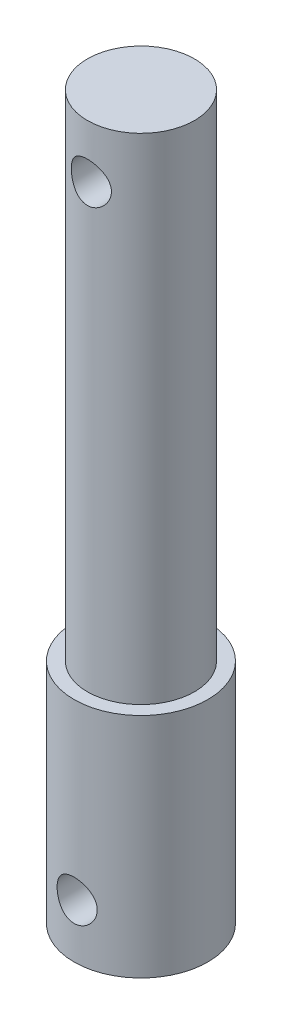
ISO-10303-21;
HEADER;
FILE_DESCRIPTION(('STEP AP214'),'2;1');
FILE_NAME('part.step','',(''),(''),'','','');
FILE_SCHEMA(('AUTOMOTIVE_DESIGN { 1 0 10303 214 1 1 1 1 }'));
ENDSEC;
DATA;
#1=APPLICATION_CONTEXT('core data for automotive mechanical design processes');
#2=APPLICATION_PROTOCOL_DEFINITION('international standard','automotive_design',2000,#1);
#3=PRODUCT_CONTEXT('',#1,'mechanical');
#4=PRODUCT('Part','Part','',(#3));
#5=PRODUCT_RELATED_PRODUCT_CATEGORY('part','',(#4));
#6=PRODUCT_DEFINITION_FORMATION('','',#4);
#7=PRODUCT_DEFINITION_CONTEXT('part definition',#1,'design');
#8=PRODUCT_DEFINITION('design','',#6,#7);
#9=PRODUCT_DEFINITION_SHAPE('','',#8);
#10=(LENGTH_UNIT() NAMED_UNIT(*) SI_UNIT(.MILLI.,.METRE.));
#11=(NAMED_UNIT(*) PLANE_ANGLE_UNIT() SI_UNIT($,.RADIAN.));
#12=(NAMED_UNIT(*) SI_UNIT($,.STERADIAN.) SOLID_ANGLE_UNIT());
#13=UNCERTAINTY_MEASURE_WITH_UNIT(LENGTH_MEASURE(1.E-05),#10,'distance_accuracy_value','');
#14=(GEOMETRIC_REPRESENTATION_CONTEXT(3) GLOBAL_UNCERTAINTY_ASSIGNED_CONTEXT((#13)) GLOBAL_UNIT_ASSIGNED_CONTEXT((#10,
#11,#12)) REPRESENTATION_CONTEXT('',''));
#15=CARTESIAN_POINT('',(0.,0.,0.));
#16=DIRECTION('',(0.,0.,1.));
#17=DIRECTION('',(1.,0.,0.));
#18=AXIS2_PLACEMENT_3D('',#15,#16,#17);
#19=CARTESIAN_POINT('',(0.,17.,0.));
#20=DIRECTION('',(0.,-1.,0.));
#21=DIRECTION('',(0.,0.,-1.));
#22=AXIS2_PLACEMENT_3D('',#19,#20,#21);
#23=CYLINDRICAL_SURFACE('',#22,5.);
#24=CARTESIAN_POINT('',(0.,5.5,-5.));
#25=CARTESIAN_POINT('',(-0.0822886127532999,5.49999900251511,-4.9999992925055));
#26=CARTESIAN_POINT('',(-0.164587318351529,5.49320613637603,-4.99794915693954));
#27=CARTESIAN_POINT('',(-0.326788125304881,5.4662786457779,-4.98997105593691));
#28=CARTESIAN_POINT('',(-0.40668950441142,5.44614004197666,-4.98404193389692));
#29=CARTESIAN_POINT('',(-0.561732707754526,5.39325398308974,-4.96895552501836));
#30=CARTESIAN_POINT('',(-0.636881364395373,5.36052513038106,-4.95980300250425));
#31=CARTESIAN_POINT('',(-0.780624181053131,5.28346390694416,-4.93922109237645));
#32=CARTESIAN_POINT('',(-0.849217467469669,5.23912999260458,-4.92779140192067));
#33=CARTESIAN_POINT('',(-0.979871797183745,5.13877599252733,-4.90350737192774));
#34=CARTESIAN_POINT('',(-1.04171807124434,5.08248337411409,-4.89062383657036));
#35=CARTESIAN_POINT('',(-1.15524920923324,4.96039077008982,-4.86505834210442));
#36=CARTESIAN_POINT('',(-1.20693236327441,4.89458918787504,-4.85237641724501));
#37=CARTESIAN_POINT('',(-1.29980037723708,4.75352924696239,-4.82834113993772));
#38=CARTESIAN_POINT('',(-1.34072309022213,4.67809153900926,-4.81702406663875));
#39=CARTESIAN_POINT('',(-1.4092139477476,4.52101074576971,-4.79743620394031));
#40=CARTESIAN_POINT('',(-1.43678529919973,4.43936915607202,-4.78916468313311));
#41=CARTESIAN_POINT('',(-1.47701633682652,4.27460973386954,-4.77690870838434));
#42=CARTESIAN_POINT('',(-1.49007196234677,4.19159725613606,-4.77281069324533));
#43=CARTESIAN_POINT('',(-1.50213730614672,4.02446684378323,-4.76902789749767));
#44=CARTESIAN_POINT('',(-1.50115042761078,3.94034918194091,-4.76934204760571));
#45=CARTESIAN_POINT('',(-1.48546977199812,3.77661609139152,-4.77424744067778));
#46=CARTESIAN_POINT('',(-1.47127205262685,3.69694774963776,-4.7786838859914));
#47=CARTESIAN_POINT('',(-1.43037420427056,3.54118021372654,-4.79108356228624));
#48=CARTESIAN_POINT('',(-1.40367284141641,3.46508137262567,-4.79904714132351));
#49=CARTESIAN_POINT('',(-1.33816026653682,3.31739965033926,-4.81772733074973));
#50=CARTESIAN_POINT('',(-1.29918816934643,3.24589291604474,-4.82848016115952));
#51=CARTESIAN_POINT('',(-1.21035222588683,3.11026797798981,-4.85150987000065));
#52=CARTESIAN_POINT('',(-1.16048574002588,3.04615157058622,-4.86378711746991));
#53=CARTESIAN_POINT('',(-1.04881290765546,2.92431380923798,-4.88911011297937));
#54=CARTESIAN_POINT('',(-0.986594907466973,2.86697133597033,-4.90216654310498));
#55=CARTESIAN_POINT('',(-0.853263259313967,2.76344601593575,-4.92712244063259));
#56=CARTESIAN_POINT('',(-0.782149051860888,2.71726387158557,-4.9390218351841));
#57=CARTESIAN_POINT('',(-0.632355038342804,2.63714007753527,-4.9604316006947));
#58=CARTESIAN_POINT('',(-0.553627749747951,2.60328248375014,-4.96992543668314));
#59=CARTESIAN_POINT('',(-0.39124541560352,2.54940040990037,-4.98533521832222));
#60=CARTESIAN_POINT('',(-0.307591751589582,2.52937207146751,-4.99125216186999));
#61=CARTESIAN_POINT('',(-0.140952242668332,2.50434782210061,-4.99868364643538));
#62=CARTESIAN_POINT('',(-0.0580500976011873,2.49883841419839,-5.0003485041779));
#63=CARTESIAN_POINT('',(0.107499605823383,2.50156915571208,-4.9995292324176));
#64=CARTESIAN_POINT('',(0.19014719669078,2.50980746965144,-4.99704565677756));
#65=CARTESIAN_POINT('',(0.350903605309697,2.53938461111149,-4.98830696987163));
#66=CARTESIAN_POINT('',(0.429072772614169,2.56042338758087,-4.98213829799417));
#67=CARTESIAN_POINT('',(0.580754638954522,2.6146432327782,-4.96674347841533));
#68=CARTESIAN_POINT('',(0.654266777025584,2.64782576103786,-4.95751696321085));
#69=CARTESIAN_POINT('',(0.796437189461052,2.72625316548113,-4.93669654351325));
#70=CARTESIAN_POINT('',(0.86494382619967,2.77175934094797,-4.92505280829675));
#71=CARTESIAN_POINT('',(0.993523307980147,2.87322475405281,-4.90073468764318));
#72=CARTESIAN_POINT('',(1.05359403235593,2.92918661188767,-4.8880600443108));
#73=CARTESIAN_POINT('',(1.16585744551027,3.05238730836934,-4.86253171869138));
#74=CARTESIAN_POINT('',(1.21768481231503,3.11996187577174,-4.84968825033268));
#75=CARTESIAN_POINT('',(1.30928995072154,3.26312793901353,-4.82576515238464));
#76=CARTESIAN_POINT('',(1.34906803829472,3.33871922455821,-4.81468547654651));
#77=CARTESIAN_POINT('',(1.41517347127168,3.49553249125469,-4.79567189615055));
#78=CARTESIAN_POINT('',(1.4415634693705,3.57672618653659,-4.78772337843827));
#79=CARTESIAN_POINT('',(1.48021730815114,3.74268796893148,-4.77591594362794));
#80=CARTESIAN_POINT('',(1.49248598978779,3.82745482078767,-4.772055625083));
#81=CARTESIAN_POINT('',(1.50221984485059,3.99436151837623,-4.76899972496087));
#82=CARTESIAN_POINT('',(1.5002805530849,4.07646365101759,-4.76961647442754));
#83=CARTESIAN_POINT('',(1.48307505444813,4.2391141033728,-4.77499401288294));
#84=CARTESIAN_POINT('',(1.46780938124716,4.31966248517635,-4.77975463592551));
#85=CARTESIAN_POINT('',(1.42476888804136,4.47594539914285,-4.79275763670386));
#86=CARTESIAN_POINT('',(1.39715175507068,4.55172728736169,-4.80095604545965));
#87=CARTESIAN_POINT('',(1.33031507121129,4.69764243881772,-4.81990278909136));
#88=CARTESIAN_POINT('',(1.29109329962876,4.76777461764076,-4.83065161194312));
#89=CARTESIAN_POINT('',(1.20048763805072,4.90316311652711,-4.85397676425833));
#90=CARTESIAN_POINT('',(1.14871276092994,4.96814876126041,-4.86660540163798));
#91=CARTESIAN_POINT('',(1.03517434629782,5.08870249830786,-4.89201320450026));
#92=CARTESIAN_POINT('',(0.973408217134501,5.14426813946776,-4.90479240823905));
#93=CARTESIAN_POINT('',(0.839465762183248,5.24602341229503,-4.92950936570649));
#94=CARTESIAN_POINT('',(0.767037885790607,5.29189144685549,-4.94141159765674));
#95=CARTESIAN_POINT('',(0.615141373983529,5.37073516990402,-4.96260680455813));
#96=CARTESIAN_POINT('',(0.535676052998955,5.40371688827451,-4.97190099931067));
#97=CARTESIAN_POINT('',(0.380757712655281,5.45289527565275,-4.98602174969301));
#98=CARTESIAN_POINT('',(0.305786961954234,5.47051167288325,-4.99122027381068));
#99=CARTESIAN_POINT('',(0.153880195230779,5.49406352524158,-4.99820944494492));
#100=CARTESIAN_POINT('',(0.0769445098581394,5.50000093270482,-5.0000006615474));
#101=CARTESIAN_POINT('',(0.,5.5,-5.));
#102=B_SPLINE_CURVE_WITH_KNOTS('',3,(#24,#25,#26,#27,#28,#29,#30,#31,#32,#33,#34,#35,#36,#37,
#38,#39,#40,#41,#42,#43,#44,#45,#46,#47,#48,#49,#50,#51,#52,#53,#54,#55,#56,#57,#58,#59,#60,#61,
#62,#63,#64,#65,#66,#67,#68,#69,#70,#71,#72,#73,#74,#75,#76,#77,#78,#79,#80,#81,#82,#83,#84,#85,
#86,#87,#88,#89,#90,#91,#92,#93,#94,#95,#96,#97,#98,#99,#100,#101),.UNSPECIFIED.,.T.,.F.,(4,2,2,
2,2,2,2,2,2,2,2,2,2,2,2,2,2,2,2,2,2,2,2,2,2,2,2,2,2,2,2,2,2,2,2,2,2,2,4),(0.,0.24658320361261,
0.493239964845999,0.739533676300874,0.985860164412702,1.23855602948191,1.49129437288633,
1.74971481004109,2.00807314543224,2.25919689356599,2.51025978319089,2.75226016697676,
2.99428443658001,3.23962426447119,3.48502360158555,3.74067104048167,3.99633456531071,
4.25371046881689,4.51101453528808,4.75908809438545,5.00712853550327,5.24956746682327,
5.49203554593729,5.74011305702908,5.98825282000191,6.24540400322819,6.50254844252681,
6.75847814951252,7.01432009460283,7.25950155466943,7.504673196616,7.74680040402721,
7.98897397553107,8.23996925679931,8.49102974897502,8.74942996156671,9.00770911595235,
9.2383169193046,9.46888616948874),.UNSPECIFIED.);
#103=CARTESIAN_POINT('',(0.,5.5,-5.));
#104=VERTEX_POINT('',#103);
#105=EDGE_CURVE('E10',#104,#104,#102,.T.);
#106=ORIENTED_EDGE('',*,*,#105,.T.);
#107=EDGE_LOOP('',(#106));
#108=FACE_BOUND('',#107,.T.);
#109=CARTESIAN_POINT('',(1.5,4.,4.76969600708473));
#110=CARTESIAN_POINT('',(1.49999897633764,3.9178054520576,4.7696968572698));
#111=CARTESIAN_POINT('',(1.49322108167142,3.83560077585597,4.77184390209069));
#112=CARTESIAN_POINT('',(1.46635844446749,3.67359475040806,4.780165783029));
#113=CARTESIAN_POINT('',(1.44626925573578,3.59379421349853,4.78634196493468));
#114=CARTESIAN_POINT('',(1.39352753269955,3.43896527172827,4.80196102485633));
#115=CARTESIAN_POINT('',(1.36089589394243,3.36392917036691,4.81139846703232));
#116=CARTESIAN_POINT('',(1.28406421917929,3.2203780660047,4.83246932547567));
#117=CARTESIAN_POINT('',(1.23986245137053,3.15186404131556,4.84410307041019));
#118=CARTESIAN_POINT('',(1.13964754141627,3.02113360942262,4.86866862185765));
#119=CARTESIAN_POINT('',(1.08333207175807,2.95915410205371,4.88162808311636));
#120=CARTESIAN_POINT('',(0.961136237579599,2.84536204867749,4.90714861936757));
#121=CARTESIAN_POINT('',(0.895254645461112,2.79355080955012,4.91970964297705));
#122=CARTESIAN_POINT('',(0.75411143779369,2.70053730016669,4.94333214579389));
#123=CARTESIAN_POINT('',(0.678684021335815,2.65957657555719,4.95435724342404));
#124=CARTESIAN_POINT('',(0.521624645369354,2.59101274095724,4.97334435920684));
#125=CARTESIAN_POINT('',(0.439994028387912,2.56340675014255,4.98130703789495));
#126=CARTESIAN_POINT('',(0.275323852630829,2.52311999890949,4.99307646003589));
#127=CARTESIAN_POINT('',(0.192391398953801,2.5100348723473,4.99699557369338));
#128=CARTESIAN_POINT('',(0.0254218237493146,2.49788267535356,5.00063201501348));
#129=CARTESIAN_POINT('',(-0.0586150620503687,2.49881266059804,5.00035022521079));
#130=CARTESIAN_POINT('',(-0.222571156600161,2.51439286854302,4.99569603817659));
#131=CARTESIAN_POINT('',(-0.302536267641342,2.52860519380987,4.9914542020526));
#132=CARTESIAN_POINT('',(-0.458889213442527,2.56963133599429,4.97951522112593));
#133=CARTESIAN_POINT('',(-0.535276821322846,2.59644595094267,4.97181785750586));
#134=CARTESIAN_POINT('',(-0.683347326351281,2.66221202341856,4.95365220986963));
#135=CARTESIAN_POINT('',(-0.754965064694478,2.70130120280727,4.94315269676706));
#136=CARTESIAN_POINT('',(-0.890764673783156,2.79039785242823,4.92049640648069));
#137=CARTESIAN_POINT('',(-0.954944774872131,2.84040791296348,4.90833923637778));
#138=CARTESIAN_POINT('',(-1.0766604815298,2.9521977507516,4.88311550488165));
#139=CARTESIAN_POINT('',(-1.13384458040112,3.01435691902974,4.87003195321461));
#140=CARTESIAN_POINT('',(-1.23707651539824,3.14751001789005,4.84483979887497));
#141=CARTESIAN_POINT('',(-1.28312324482853,3.21850482538923,4.8327312931702));
#142=CARTESIAN_POINT('',(-1.3631399533545,3.36823946924899,4.81077903197678));
#143=CARTESIAN_POINT('',(-1.39698989237679,3.44704704586292,4.80095810695957));
#144=CARTESIAN_POINT('',(-1.45083362878413,3.60960720844554,4.78496392548436));
#145=CARTESIAN_POINT('',(-1.4708319464056,3.69335817153456,4.7787894791583));
#146=CARTESIAN_POINT('',(-1.49574770282165,3.86008236073928,4.77104849541241));
#147=CARTESIAN_POINT('',(-1.50119946380212,3.94296822389398,4.7693187867044));
#148=CARTESIAN_POINT('',(-1.49835947233062,4.10847290000987,4.77021192441924));
#149=CARTESIAN_POINT('',(-1.4900696437133,4.19109174873085,4.77283416156589));
#150=CARTESIAN_POINT('',(-1.4604576357419,4.35148837797087,4.78197558554912));
#151=CARTESIAN_POINT('',(-1.4394796143128,4.42933616426352,4.78839176507489));
#152=CARTESIAN_POINT('',(-1.3854857774794,4.58040169081492,4.80429141231227));
#153=CARTESIAN_POINT('',(-1.35246810342759,4.65361871414057,4.81377535359073));
#154=CARTESIAN_POINT('',(-1.274318711965,4.79551746407213,4.83505835023047));
#155=CARTESIAN_POINT('',(-1.22888564172729,4.86402472098579,4.84691271069799));
#156=CARTESIAN_POINT('',(-1.12755301600385,4.9926381061808,4.87148205646987));
#157=CARTESIAN_POINT('',(-1.07165095534897,5.05274221761279,4.88419724730003));
#158=CARTESIAN_POINT('',(-0.948455132493598,5.16518040581474,4.90963633548158));
#159=CARTESIAN_POINT('',(-0.880811065857434,5.21713562898698,4.92234245063004));
#160=CARTESIAN_POINT('',(-0.737461784590249,5.30896670102775,4.94584851748651));
#161=CARTESIAN_POINT('',(-0.661756970543943,5.34884314978146,4.95664856384717));
#162=CARTESIAN_POINT('',(-0.504935504705221,5.41500003056829,4.97505970474957));
#163=CARTESIAN_POINT('',(-0.423864622037839,5.44138201615898,4.98269453424966));
#164=CARTESIAN_POINT('',(-0.258169966504588,5.48006091889042,4.99401979596827));
#165=CARTESIAN_POINT('',(-0.173547217354762,5.49236186594842,4.9977113567088));
#166=CARTESIAN_POINT('',(-0.00665215388274264,5.5022230440545,5.00066544081399));
#167=CARTESIAN_POINT('',(0.0755851790862068,5.50033269540783,5.00009305111322));
#168=CARTESIAN_POINT('',(0.238519481164404,5.48317836750088,4.99497264465037));
#169=CARTESIAN_POINT('',(0.319216537346529,5.46791514651956,4.99042485330463));
#170=CARTESIAN_POINT('',(0.475935813041358,5.42478833860037,4.97791168358327));
#171=CARTESIAN_POINT('',(0.551998927351392,5.39706181935099,4.96998352900866));
#172=CARTESIAN_POINT('',(0.698433237752053,5.32991808549281,4.9515294303945));
#173=CARTESIAN_POINT('',(0.76880349605058,5.29049894971381,4.94100305949946));
#174=CARTESIAN_POINT('',(0.904301892420563,5.19962654256996,4.91803965828228));
#175=CARTESIAN_POINT('',(0.969190250076766,5.14782856999923,4.90555226923559));
#176=CARTESIAN_POINT('',(1.08953757134594,5.0342896116672,4.88023537212334));
#177=CARTESIAN_POINT('',(1.14499380960193,4.97254576210185,4.86740576641079));
#178=CARTESIAN_POINT('',(1.24656269394549,4.83865922168949,4.84240680631319));
#179=CARTESIAN_POINT('',(1.29234759757956,4.76626144660956,4.83026852693485));
#180=CARTESIAN_POINT('',(1.37104313528776,4.61444482583898,4.80852547508793));
#181=CARTESIAN_POINT('',(1.40395995557289,4.5350293763988,4.79891948596955));
#182=CARTESIAN_POINT('',(1.4530194253295,4.38025956839372,4.78427816717595));
#183=CARTESIAN_POINT('',(1.47058859011232,4.30539135306901,4.7788615484052));
#184=CARTESIAN_POINT('',(1.49407818835144,4.15368477750423,4.77157042597167));
#185=CARTESIAN_POINT('',(1.50000095706095,4.07684681535475,4.7696952122143));
#186=CARTESIAN_POINT('',(1.5,4.,4.76969600708473));
#187=B_SPLINE_CURVE_WITH_KNOTS('',3,(#109,#110,#111,#112,#113,#114,#115,#116,#117,#118,#119,
#120,#121,#122,#123,#124,#125,#126,#127,#128,#129,#130,#131,#132,#133,#134,#135,#136,#137,#138,
#139,#140,#141,#142,#143,#144,#145,#146,#147,#148,#149,#150,#151,#152,#153,#154,#155,#156,#157,
#158,#159,#160,#161,#162,#163,#164,#165,#166,#167,#168,#169,#170,#171,#172,#173,#174,#175,#176,
#177,#178,#179,#180,#181,#182,#183,#184,#185,#186),.UNSPECIFIED.,.T.,.F.,(4,2,2,2,2,2,2,2,2,2,2,
2,2,2,2,2,2,2,2,2,2,2,2,2,2,2,2,2,2,2,2,2,2,2,2,2,2,2,4),(0.,0.246300165915542,0.492682641689,
0.738656414466194,0.984667025370101,1.23773150007984,1.49082847871273,1.74915939273645,
2.00743455587877,2.25832140149558,2.5091555410144,2.7520012599088,2.99486235890376,
3.24055209335676,3.4863001659083,3.74152147023278,3.99676812491863,4.25446238246266,
4.51207250628411,4.76008080790309,5.00805439107388,5.24958594938817,5.49115481045787,
5.73920731809388,5.98731925928923,6.24479506100602,6.50225807324202,6.75775391814325,
7.01317662321682,7.2587630391122,7.50433553047755,7.74727096872219,7.99024634491378,
8.24099627054488,8.4918185262989,8.75011639669147,9.00828993963944,9.23861153857448,
9.4688869503356),.UNSPECIFIED.);
#188=CARTESIAN_POINT('',(1.5,4.,4.76969600708473));
#189=VERTEX_POINT('',#188);
#190=EDGE_CURVE('E53',#189,#189,#187,.T.);
#191=ORIENTED_EDGE('',*,*,#190,.T.);
#192=EDGE_LOOP('',(#191));
#193=FACE_BOUND('',#192,.T.);
#194=CARTESIAN_POINT('',(0.,17.,0.));
#195=DIRECTION('',(0.,1.,0.));
#196=DIRECTION('',(0.,0.,1.));
#197=AXIS2_PLACEMENT_3D('',#194,#195,#196);
#198=CIRCLE('',#197,5.);
#199=CARTESIAN_POINT('',(0.,17.,5.));
#200=VERTEX_POINT('',#199);
#201=EDGE_CURVE('E58',#200,#200,#198,.T.);
#202=ORIENTED_EDGE('',*,*,#201,.F.);
#203=EDGE_LOOP('',(#202));
#204=FACE_BOUND('',#203,.T.);
#205=CARTESIAN_POINT('',(0.,0.,0.));
#206=DIRECTION('',(0.,1.,0.));
#207=DIRECTION('',(0.,0.,1.));
#208=AXIS2_PLACEMENT_3D('',#205,#206,#207);
#209=CIRCLE('',#208,5.);
#210=CARTESIAN_POINT('',(0.,0.,5.));
#211=VERTEX_POINT('',#210);
#212=EDGE_CURVE('E63',#211,#211,#209,.T.);
#213=ORIENTED_EDGE('',*,*,#212,.T.);
#214=EDGE_LOOP('',(#213));
#215=FACE_BOUND('',#214,.T.);
#216=ADVANCED_FACE('F41',(#108,#193,#204,#215),#23,.T.);
#217=CARTESIAN_POINT('',(0.,17.,0.));
#218=DIRECTION('',(0.,1.,0.));
#219=DIRECTION('',(0.,0.,1.));
#220=AXIS2_PLACEMENT_3D('',#217,#218,#219);
#221=PLANE('',#220);
#222=CARTESIAN_POINT('',(0.,17.,0.));
#223=DIRECTION('',(0.,1.,0.));
#224=DIRECTION('',(0.,0.,1.));
#225=AXIS2_PLACEMENT_3D('',#222,#223,#224);
#226=CIRCLE('',#225,4.);
#227=CARTESIAN_POINT('',(0.,17.,4.));
#228=VERTEX_POINT('',#227);
#229=EDGE_CURVE('E104',#228,#228,#226,.F.);
#230=ORIENTED_EDGE('',*,*,#229,.T.);
#231=EDGE_LOOP('',(#230));
#232=FACE_BOUND('',#231,.T.);
#233=ORIENTED_EDGE('',*,*,#201,.T.);
#234=EDGE_LOOP('',(#233));
#235=FACE_BOUND('',#234,.T.);
#236=ADVANCED_FACE('F93',(#232,#235),#221,.T.);
#237=CARTESIAN_POINT('',(0.,0.,0.));
#238=DIRECTION('',(0.,1.,0.));
#239=DIRECTION('',(0.,0.,1.));
#240=AXIS2_PLACEMENT_3D('',#237,#238,#239);
#241=PLANE('',#240);
#242=ORIENTED_EDGE('',*,*,#212,.F.);
#243=EDGE_LOOP('',(#242));
#244=FACE_BOUND('',#243,.T.);
#245=ADVANCED_FACE('F91',(#244),#241,.F.);
#246=CARTESIAN_POINT('',(0.,54.,0.));
#247=DIRECTION('',(0.,-1.,0.));
#248=DIRECTION('',(0.,0.,-1.));
#249=AXIS2_PLACEMENT_3D('',#246,#247,#248);
#250=CYLINDRICAL_SURFACE('',#249,4.);
#251=CARTESIAN_POINT('',(0.,51.5,-4.));
#252=CARTESIAN_POINT('',(-0.0812350589378532,51.5000029023031,-4.00000217456151));
#253=CARTESIAN_POINT('',(-0.162450241781793,51.4933802397516,-3.99750379283184));
#254=CARTESIAN_POINT('',(-0.322453452352362,51.4671718047301,-3.98778696006928));
#255=CARTESIAN_POINT('',(-0.401241827987616,51.4475878995294,-3.98056918893993));
#256=CARTESIAN_POINT('',(-0.55406078499088,51.3962469982282,-3.96218832391545));
#257=CARTESIAN_POINT('',(-0.628100224162281,51.3645134831782,-3.9510328434944));
#258=CARTESIAN_POINT('',(-0.769799310160257,51.2898935869842,-3.92588767765353));
#259=CARTESIAN_POINT('',(-0.837457239177881,51.2470042144558,-3.91189723227548));
#260=CARTESIAN_POINT('',(-0.967346417045826,51.1493874689291,-3.88186246971217));
#261=CARTESIAN_POINT('',(-1.02927073015119,51.0942697377406,-3.86576002583566));
#262=CARTESIAN_POINT('',(-1.14324421474363,50.9745895653412,-3.83360220871327));
#263=CARTESIAN_POINT('',(-1.19529036359203,50.9100242439121,-3.81754685135033));
#264=CARTESIAN_POINT('',(-1.28998202215985,50.7702825324768,-3.78662470617731));
#265=CARTESIAN_POINT('',(-1.3321939319576,50.6947956334542,-3.77182648820818));
#266=CARTESIAN_POINT('',(-1.40318646334084,50.5371516458315,-3.74599860237433));
#267=CARTESIAN_POINT('',(-1.43197244961239,50.4549972368449,-3.73496742975881));
#268=CARTESIAN_POINT('',(-1.47408431017549,50.2898832597418,-3.71854412824136));
#269=CARTESIAN_POINT('',(-1.48799593218558,50.2070949615646,-3.71293924350838));
#270=CARTESIAN_POINT('',(-1.50179556531648,50.0401838420062,-3.70738061461215));
#271=CARTESIAN_POINT('',(-1.50168936802631,49.9560615861255,-3.70742453659305));
#272=CARTESIAN_POINT('',(-1.48790429610018,49.794230474787,-3.71297511632055));
#273=CARTESIAN_POINT('',(-1.47503808509004,49.7164390939558,-3.71815468871122));
#274=CARTESIAN_POINT('',(-1.4374416786833,49.5642128495947,-3.73284938059529));
#275=CARTESIAN_POINT('',(-1.41270969663258,49.4897784933861,-3.74236515298863));
#276=CARTESIAN_POINT('',(-1.35163748571904,49.3447229322718,-3.76485702190253));
#277=CARTESIAN_POINT('',(-1.31508648737101,49.2742005138787,-3.77789517988166));
#278=CARTESIAN_POINT('',(-1.23156073762698,49.140054262409,-3.80594210139319));
#279=CARTESIAN_POINT('',(-1.18458238728897,49.0764328224803,-3.82095154457158));
#280=CARTESIAN_POINT('',(-1.07781780766549,48.9533963363491,-3.85248038859113));
#281=CARTESIAN_POINT('',(-1.01738298716956,48.8945513592519,-3.86903347455671));
#282=CARTESIAN_POINT('',(-0.88731259081902,48.7876620337942,-3.90091728164086));
#283=CARTESIAN_POINT('',(-0.817675603497361,48.7396193453943,-3.91624781465952));
#284=CARTESIAN_POINT('',(-0.669723436992414,48.6550696029375,-3.9442639480908));
#285=CARTESIAN_POINT('',(-0.591290713844715,48.6187524187789,-3.95690498259616));
#286=CARTESIAN_POINT('',(-0.42883685052458,48.56001739573,-3.97778718326962));
#287=CARTESIAN_POINT('',(-0.344818210845765,48.5375933834389,-3.98603030341493));
#288=CARTESIAN_POINT('',(-0.178375243148663,48.5083772124581,-3.99684443228065));
#289=CARTESIAN_POINT('',(-0.0961036195622073,48.5008173936175,-3.99969369025686));
#290=CARTESIAN_POINT('',(0.068572475255026,48.4993089361001,-4.00025893700126));
#291=CARTESIAN_POINT('',(0.150976912983374,48.5053572796832,-3.99797606386863));
#292=CARTESIAN_POINT('',(0.310262048561861,48.5303100423087,-3.98871709772643));
#293=CARTESIAN_POINT('',(0.387233328007338,48.5487115437371,-3.98192470962305));
#294=CARTESIAN_POINT('',(0.536941754957223,48.5971860725473,-3.96451477091717));
#295=CARTESIAN_POINT('',(0.609678350347536,48.627260617948,-3.9538967228203));
#296=CARTESIAN_POINT('',(0.751247765110156,48.6991864124395,-3.92949624407681));
#297=CARTESIAN_POINT('',(0.819903083557796,48.7413577292234,-3.91563000209348));
#298=CARTESIAN_POINT('',(0.949392711726626,48.8359181031716,-3.88626671564664));
#299=CARTESIAN_POINT('',(1.01022412027045,48.8883109325452,-3.87076907009516));
#300=CARTESIAN_POINT('',(1.12603079874454,49.0054041221243,-3.8387332949099));
#301=CARTESIAN_POINT('',(1.18046154123569,49.0706421827727,-3.82218696503729));
#302=CARTESIAN_POINT('',(1.27771050031903,49.2096513847077,-3.79078815746854));
#303=CARTESIAN_POINT('',(1.32052767414518,49.2834232913885,-3.77593583194399));
#304=CARTESIAN_POINT('',(1.39337773518998,49.4380159867723,-3.74966829822463));
#305=CARTESIAN_POINT('',(1.42335685446918,49.5188647459104,-3.73826760328493));
#306=CARTESIAN_POINT('',(1.46907883466889,49.6850097636878,-3.72054032891005));
#307=CARTESIAN_POINT('',(1.48483050305535,49.7703032361981,-3.71421061057491));
#308=CARTESIAN_POINT('',(1.50086347097839,49.9370161595411,-3.70775894792573));
#309=CARTESIAN_POINT('',(1.50207331495837,50.0183326317169,-3.70726444523341));
#310=CARTESIAN_POINT('',(1.49136715641593,50.1799453162762,-3.71158412745292));
#311=CARTESIAN_POINT('',(1.47945239850123,50.2602416246716,-3.71639780898899));
#312=CARTESIAN_POINT('',(1.44355815630242,50.4150472267166,-3.73048141585433));
#313=CARTESIAN_POINT('',(1.41995798316524,50.4896583462453,-3.73961085376663));
#314=CARTESIAN_POINT('',(1.3616969677992,50.6339055084944,-3.76121548297845));
#315=CARTESIAN_POINT('',(1.32703332944944,50.7035402880702,-3.77369151995215));
#316=CARTESIAN_POINT('',(1.24552075938153,50.8398267896976,-3.80139723903965));
#317=CARTESIAN_POINT('',(1.1981283280301,50.9061307967999,-3.81673698440964));
#318=CARTESIAN_POINT('',(1.09334485729906,51.0301415609712,-3.84806246757177));
#319=CARTESIAN_POINT('',(1.03595064012808,51.0878455747868,-3.86404840943145));
#320=CARTESIAN_POINT('',(0.909080396784618,51.1962019558218,-3.89590424609881));
#321=CARTESIAN_POINT('',(0.839118644212988,51.2463037534347,-3.91172104900645));
#322=CARTESIAN_POINT('',(0.691213223200817,51.3340226552766,-3.94054514457031));
#323=CARTESIAN_POINT('',(0.613268934090618,51.3716387877364,-3.95355221851559));
#324=CARTESIAN_POINT('',(0.447999082002309,51.4343768290483,-3.9757429260668));
#325=CARTESIAN_POINT('',(0.360413422234206,51.4588870646019,-3.98473657158356));
#326=CARTESIAN_POINT('',(0.18187573360638,51.4916929599207,-3.99686242179587));
#327=CARTESIAN_POINT('',(0.0909254163648584,51.4999967514873,-3.99999756603967));
#328=CARTESIAN_POINT('',(0.,51.5,-4.));
#329=B_SPLINE_CURVE_WITH_KNOTS('',3,(#251,#252,#253,#254,#255,#256,#257,#258,#259,#260,#261,
#262,#263,#264,#265,#266,#267,#268,#269,#270,#271,#272,#273,#274,#275,#276,#277,#278,#279,#280,
#281,#282,#283,#284,#285,#286,#287,#288,#289,#290,#291,#292,#293,#294,#295,#296,#297,#298,#299,
#300,#301,#302,#303,#304,#305,#306,#307,#308,#309,#310,#311,#312,#313,#314,#315,#316,#317,#318,
#319,#320,#321,#322,#323,#324,#325,#326,#327,#328),.UNSPECIFIED.,.T.,.F.,(4,2,2,2,2,2,2,2,2,2,2,
2,2,2,2,2,2,2,2,2,2,2,2,2,2,2,2,2,2,2,2,2,2,2,2,2,2,2,4),(0.,0.24336980156056,0.486704549530462,
0.729571369213578,0.972503379609492,1.22473618582716,1.47704604925622,1.73896674501659,
2.00078269352134,2.25185874416901,2.50283106079707,2.73878345119971,2.97477138060588,
3.21522408387018,3.45575990744258,3.71246153335813,3.96920257905066,4.22991375286076,
4.49050899698846,4.73725019635926,4.98393668390521,5.2211443792384,5.45838293254454,
5.702592218596,5.94689180019868,6.20536519455658,6.46386178920141,6.72343066727205,
6.98283874956507,7.22558763480252,7.46831350211259,7.70363142426534,7.93900886656507,
8.18672471884272,8.43451941997062,8.69572329654039,8.95694749805102,9.22948515032042,
9.50188601796127),.UNSPECIFIED.);
#330=CARTESIAN_POINT('',(0.,51.5,-4.));
#331=VERTEX_POINT('',#330);
#332=EDGE_CURVE('E69',#331,#331,#329,.T.);
#333=ORIENTED_EDGE('',*,*,#332,.T.);
#334=EDGE_LOOP('',(#333));
#335=FACE_BOUND('',#334,.T.);
#336=CARTESIAN_POINT('',(1.5,50.,3.70809924354783));
#337=CARTESIAN_POINT('',(1.50000304106109,49.9189925162792,3.70809640633806));
#338=CARTESIAN_POINT('',(1.49341597549487,49.8380050774964,3.71078260240986));
#339=CARTESIAN_POINT('',(1.46736187895468,49.6784719170868,3.72116159304967));
#340=CARTESIAN_POINT('',(1.44789523373263,49.599926122405,3.72885423767112));
#341=CARTESIAN_POINT('',(1.39689657610574,49.4476246283865,3.748254802809));
#342=CARTESIAN_POINT('',(1.36539347266348,49.3738579433489,3.7599530956926));
#343=CARTESIAN_POINT('',(1.29131856742697,49.2326281031812,3.78603134206598));
#344=CARTESIAN_POINT('',(1.24874344095038,49.1651668497175,3.80041210067323));
#345=CARTESIAN_POINT('',(1.15146661374162,49.0351096883772,3.83103574665713));
#346=CARTESIAN_POINT('',(1.09630381213306,48.9728714703706,3.84733341923603));
#347=CARTESIAN_POINT('',(0.976395839778927,48.8582771853285,3.87949750628547));
#348=CARTESIAN_POINT('',(0.911648630256682,48.8059232262582,3.89536382814785));
#349=CARTESIAN_POINT('',(0.771694655177603,48.7108604877044,3.92552873936553));
#350=CARTESIAN_POINT('',(0.696206947538029,48.6685405252841,3.93975561223505));
#351=CARTESIAN_POINT('',(0.538555771965247,48.5973488274751,3.96438007973847));
#352=CARTESIAN_POINT('',(0.456394630933535,48.568472428008,3.97477900217006));
#353=CARTESIAN_POINT('',(0.291489341676831,48.5262421042254,3.9901869710344));
#354=CARTESIAN_POINT('',(0.208923197281595,48.5122723725596,3.99540915214774));
#355=CARTESIAN_POINT('',(0.0424643637947854,48.498278799055,4.0006401410794));
#356=CARTESIAN_POINT('',(-0.0414278850628336,48.4982504223813,4.00065064414902));
#357=CARTESIAN_POINT('',(-0.203743543064476,48.5117817614652,3.99559265903894));
#358=CARTESIAN_POINT('',(-0.2822321782669,48.5246692979488,3.99077541996683));
#359=CARTESIAN_POINT('',(-0.435839217984391,48.5625359152256,3.97693274932263));
#360=CARTESIAN_POINT('',(-0.510957383430299,48.587515852262,3.96790701975577));
#361=CARTESIAN_POINT('',(-0.656989017303104,48.6491704516759,3.94637769167531));
#362=CARTESIAN_POINT('',(-0.727825392287308,48.6860100052684,3.93382539470077));
#363=CARTESIAN_POINT('',(-0.862486607957558,48.7701920969294,3.90651310225279));
#364=CARTESIAN_POINT('',(-0.926309176932323,48.8175380230176,3.8917523951284));
#365=CARTESIAN_POINT('',(-1.04909048680094,48.9246272862832,3.86052529655816));
#366=CARTESIAN_POINT('',(-1.10754614526348,48.9849339156504,3.84400963763883));
#367=CARTESIAN_POINT('',(-1.21370395569342,49.1145929933216,3.81182460645722));
#368=CARTESIAN_POINT('',(-1.261403406929,49.1839477065866,3.79615544748847));
#369=CARTESIAN_POINT('',(-1.34565611808152,49.3317194674628,3.76712703500335));
#370=CARTESIAN_POINT('',(-1.38193847851831,49.4103034936861,3.75382677150277));
#371=CARTESIAN_POINT('',(-1.44056464441501,49.5730962251676,3.73172438629002));
#372=CARTESIAN_POINT('',(-1.46291620605595,49.6573017715937,3.72291976205783));
#373=CARTESIAN_POINT('',(-1.49190191709668,49.823975962316,3.71139597222848));
#374=CARTESIAN_POINT('',(-1.49933521158966,49.9062841055362,3.70836785241537));
#375=CARTESIAN_POINT('',(-1.50057885636272,50.0710093567418,3.70786539525016));
#376=CARTESIAN_POINT('',(-1.49439261093762,50.1534264323525,3.71038967003987));
#377=CARTESIAN_POINT('',(-1.46929733520157,50.3119299222877,3.72039381629735));
#378=CARTESIAN_POINT('',(-1.45100618334224,50.3881311357647,3.72763276216449));
#379=CARTESIAN_POINT('',(-1.40299774640637,50.5363479447202,3.74596487046362));
#380=CARTESIAN_POINT('',(-1.37327812034623,50.6083626791681,3.75705882250173));
#381=CARTESIAN_POINT('',(-1.30200292275278,50.7491644380762,3.7823624311608));
#382=CARTESIAN_POINT('',(-1.26004545177047,50.8177292921373,3.79667328892065));
#383=CARTESIAN_POINT('',(-1.16591317862479,50.947128981726,3.82662814294291));
#384=CARTESIAN_POINT('',(-1.11373463696435,51.0079609746246,3.84227262594077));
#385=CARTESIAN_POINT('',(-0.996727340900937,51.1241683731951,3.87433046553184));
#386=CARTESIAN_POINT('',(-0.93130634149106,51.1789534087688,3.89072969357028));
#387=CARTESIAN_POINT('',(-0.79179747175315,51.2768383675894,3.92149874963302));
#388=CARTESIAN_POINT('',(-0.717709573322673,51.3199382529458,3.93586857107664));
#389=CARTESIAN_POINT('',(-0.563016329468477,51.3929460561996,3.96094985704552));
#390=CARTESIAN_POINT('',(-0.482434433064626,51.4228991237926,3.9716738133801));
#391=CARTESIAN_POINT('',(-0.316881887523252,51.4686564138499,3.98829436712571));
#392=CARTESIAN_POINT('',(-0.23191332072359,51.4844672854224,3.99419323299412));
#393=CARTESIAN_POINT('',(-0.0653355852738131,51.5007744027548,4.00028407317073));
#394=CARTESIAN_POINT('',(0.0161807680608475,51.502109483059,4.00078860953764));
#395=CARTESIAN_POINT('',(0.178226786412425,51.4915848405546,3.99684889809223));
#396=CARTESIAN_POINT('',(0.258756569245258,51.4797267091141,3.9924052471313));
#397=CARTESIAN_POINT('',(0.414548248377129,51.4437411485064,3.97921089603771));
#398=CARTESIAN_POINT('',(0.48989073106884,51.4199200941217,3.97056791378017));
#399=CARTESIAN_POINT('',(0.635515473006395,51.3609899866156,3.9498778362099));
#400=CARTESIAN_POINT('',(0.705796771275545,51.3258787966952,3.93783009655664));
#401=CARTESIAN_POINT('',(0.842540176994413,51.2436860564952,3.91090618300074));
#402=CARTESIAN_POINT('',(0.908717548846851,51.1961633594859,3.89593240108828));
#403=CARTESIAN_POINT('',(1.03241734752336,51.0911921698124,3.86499507694844));
#404=CARTESIAN_POINT('',(1.0899366712559,51.0337401341921,3.84903118274027));
#405=CARTESIAN_POINT('',(1.19781214236196,50.9069358683549,3.81688129739175));
#406=CARTESIAN_POINT('',(1.24762999816025,50.8371155978457,3.8007280534916));
#407=CARTESIAN_POINT('',(1.33484709556844,50.6895841304267,3.77098325003638));
#408=CARTESIAN_POINT('',(1.37224504878157,50.6118721159465,3.75739195631216));
#409=CARTESIAN_POINT('',(1.43465886974261,50.4470443190246,3.73402269853266));
#410=CARTESIAN_POINT('',(1.45906002899523,50.3596656334882,3.7244380329086));
#411=CARTESIAN_POINT('',(1.49172356722079,50.1815147280442,3.71147994336315));
#412=CARTESIAN_POINT('',(1.49999659339571,50.09074478729,3.70810242179736));
#413=CARTESIAN_POINT('',(1.5,50.,3.70809924354783));
#414=B_SPLINE_CURVE_WITH_KNOTS('',3,(#336,#337,#338,#339,#340,#341,#342,#343,#344,#345,#346,
#347,#348,#349,#350,#351,#352,#353,#354,#355,#356,#357,#358,#359,#360,#361,#362,#363,#364,#365,
#366,#367,#368,#369,#370,#371,#372,#373,#374,#375,#376,#377,#378,#379,#380,#381,#382,#383,#384,
#385,#386,#387,#388,#389,#390,#391,#392,#393,#394,#395,#396,#397,#398,#399,#400,#401,#402,#403,
#404,#405,#406,#407,#408,#409,#410,#411,#412,#413),.UNSPECIFIED.,.T.,.F.,(4,2,2,2,2,2,2,2,2,2,2,
2,2,2,2,2,2,2,2,2,2,2,2,2,2,2,2,2,2,2,2,2,2,2,2,2,2,2,4),(0.,0.242684541416171,
0.485361814598854,0.727459856757041,0.969630679682934,1.22274652401128,1.47591628822983,
1.73770072136421,1.9993942638133,2.24980018489679,2.50012465404857,2.73806472803194,
2.97602165263335,3.21744131210668,3.45893893628976,3.71456675065875,3.97025867827335,
4.23162592252967,4.49284751635475,4.73965657740486,4.98640395388885,5.22143845928199,
5.45652113429527,5.70041561005821,5.94439948466355,6.20385016993624,6.46330169650178,
6.72185508890169,6.98028685560127,7.22365720549936,7.4669982031948,7.70440274003891,
7.94185223512831,8.18928323676987,8.43680270894964,8.6973859954208,8.95799630544243,
9.23003178870928,9.50188762323053),.UNSPECIFIED.);
#415=CARTESIAN_POINT('',(1.5,50.,3.70809924354783));
#416=VERTEX_POINT('',#415);
#417=EDGE_CURVE('E95',#416,#416,#414,.T.);
#418=ORIENTED_EDGE('',*,*,#417,.T.);
#419=EDGE_LOOP('',(#418));
#420=FACE_BOUND('',#419,.T.);
#421=ORIENTED_EDGE('',*,*,#229,.F.);
#422=EDGE_LOOP('',(#421));
#423=FACE_BOUND('',#422,.T.);
#424=CARTESIAN_POINT('',(0.,54.,0.));
#425=DIRECTION('',(0.,1.,0.));
#426=DIRECTION('',(0.,0.,1.));
#427=AXIS2_PLACEMENT_3D('',#424,#425,#426);
#428=CIRCLE('',#427,4.);
#429=CARTESIAN_POINT('',(0.,54.,4.));
#430=VERTEX_POINT('',#429);
#431=EDGE_CURVE('E109',#430,#430,#428,.T.);
#432=ORIENTED_EDGE('',*,*,#431,.F.);
#433=EDGE_LOOP('',(#432));
#434=FACE_BOUND('',#433,.T.);
#435=ADVANCED_FACE('F86',(#335,#420,#423,#434),#250,.T.);
#436=CARTESIAN_POINT('',(0.,54.,0.));
#437=DIRECTION('',(0.,1.,0.));
#438=DIRECTION('',(0.,0.,1.));
#439=AXIS2_PLACEMENT_3D('',#436,#437,#438);
#440=PLANE('',#439);
#441=ORIENTED_EDGE('',*,*,#431,.T.);
#442=EDGE_LOOP('',(#441));
#443=FACE_BOUND('',#442,.T.);
#444=ADVANCED_FACE('F83',(#443),#440,.T.);
#445=CARTESIAN_POINT('',(0.,50.,-5.));
#446=DIRECTION('',(0.,0.,1.));
#447=DIRECTION('',(1.,0.,0.));
#448=AXIS2_PLACEMENT_3D('',#445,#446,#447);
#449=CYLINDRICAL_SURFACE('',#448,1.5);
#450=ORIENTED_EDGE('',*,*,#417,.F.);
#451=EDGE_LOOP('',(#450));
#452=FACE_BOUND('',#451,.T.);
#453=ORIENTED_EDGE('',*,*,#332,.F.);
#454=EDGE_LOOP('',(#453));
#455=FACE_BOUND('',#454,.T.);
#456=ADVANCED_FACE('F80',(#452,#455),#449,.F.);
#457=CARTESIAN_POINT('',(0.,4.,-5.));
#458=DIRECTION('',(0.,0.,1.));
#459=DIRECTION('',(1.,0.,0.));
#460=AXIS2_PLACEMENT_3D('',#457,#458,#459);
#461=CYLINDRICAL_SURFACE('',#460,1.5);
#462=ORIENTED_EDGE('',*,*,#190,.F.);
#463=EDGE_LOOP('',(#462));
#464=FACE_BOUND('',#463,.T.);
#465=ORIENTED_EDGE('',*,*,#105,.F.);
#466=EDGE_LOOP('',(#465));
#467=FACE_BOUND('',#466,.T.);
#468=ADVANCED_FACE('F76',(#464,#467),#461,.F.);
#469=CLOSED_SHELL('',(#216,#236,#245,#435,#444,#456,#468));
#470=MANIFOLD_SOLID_BREP('B2',#469);
#471=ADVANCED_BREP_SHAPE_REPRESENTATION('',(#18,#470),#14);
#472=SHAPE_DEFINITION_REPRESENTATION(#9,#471);
ENDSEC;
END-ISO-10303-21;
